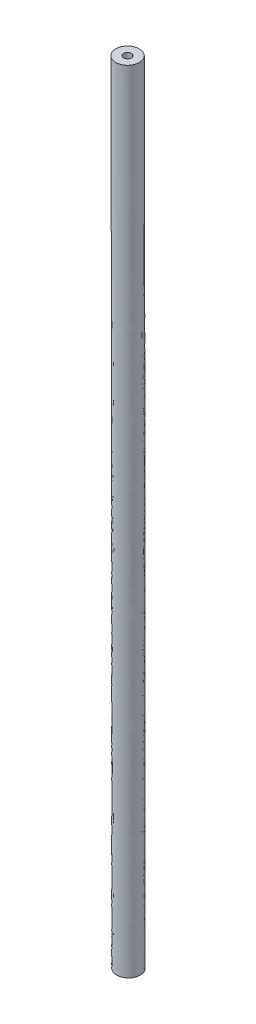
ISO-10303-21;
HEADER;
FILE_DESCRIPTION(('STEP AP214'),'2;1');
FILE_NAME('part.step','',(''),(''),'','','');
FILE_SCHEMA(('AUTOMOTIVE_DESIGN { 1 0 10303 214 1 1 1 1 }'));
ENDSEC;
DATA;
#1=APPLICATION_CONTEXT('core data for automotive mechanical design processes');
#2=APPLICATION_PROTOCOL_DEFINITION('international standard','automotive_design',2000,#1);
#3=PRODUCT_CONTEXT('',#1,'mechanical');
#4=PRODUCT('Part','Part','',(#3));
#5=PRODUCT_RELATED_PRODUCT_CATEGORY('part','',(#4));
#6=PRODUCT_DEFINITION_FORMATION('','',#4);
#7=PRODUCT_DEFINITION_CONTEXT('part definition',#1,'design');
#8=PRODUCT_DEFINITION('design','',#6,#7);
#9=PRODUCT_DEFINITION_SHAPE('','',#8);
#10=(LENGTH_UNIT() NAMED_UNIT(*) SI_UNIT(.MILLI.,.METRE.));
#11=(NAMED_UNIT(*) PLANE_ANGLE_UNIT() SI_UNIT($,.RADIAN.));
#12=(NAMED_UNIT(*) SI_UNIT($,.STERADIAN.) SOLID_ANGLE_UNIT());
#13=UNCERTAINTY_MEASURE_WITH_UNIT(LENGTH_MEASURE(1.E-05),#10,'distance_accuracy_value','');
#14=(GEOMETRIC_REPRESENTATION_CONTEXT(3) GLOBAL_UNCERTAINTY_ASSIGNED_CONTEXT((#13)) GLOBAL_UNIT_ASSIGNED_CONTEXT((#10,
#11,#12)) REPRESENTATION_CONTEXT('',''));
#15=CARTESIAN_POINT('',(0.,0.,0.));
#16=DIRECTION('',(0.,0.,1.));
#17=DIRECTION('',(1.,0.,0.));
#18=AXIS2_PLACEMENT_3D('',#15,#16,#17);
#19=CARTESIAN_POINT('',(0.,0.,1.5));
#20=CARTESIAN_POINT('',(0.,8.33333333335613,1.5));
#21=CARTESIAN_POINT('',(1.1843399654323E-07,16.6666666666842,1.5));
#22=CARTESIAN_POINT('',(-2.36868233125933E-07,41.6666840276966,1.5));
#23=CARTESIAN_POINT('',(-0.0208335396008937,58.3333680546949,1.5));
#24=CARTESIAN_POINT('',(-0.083333163740996,83.3333333337121,1.5));
#25=CARTESIAN_POINT('',(-0.104166609703206,91.6666666666926,1.5));
#26=CARTESIAN_POINT('',(-0.124999951173884,100.,1.5));
#27=CARTESIAN_POINT('',(3.,0.,1.5));
#28=CARTESIAN_POINT('',(3.,8.33333333335613,1.5));
#29=CARTESIAN_POINT('',(3.00000011844845,16.6660416683961,1.5));
#30=CARTESIAN_POINT('',(2.99999976310286,41.6679340255749,1.5));
#31=CARTESIAN_POINT('',(2.97916021038792,58.339618040183,1.5));
#32=CARTESIAN_POINT('',(2.91665589881627,83.3414583115083,1.5));
#33=CARTESIAN_POINT('',(2.89582401533342,91.6741666461848,1.5));
#34=CARTESIAN_POINT('',(2.87499067386274,100.007499979492,1.5));
#35=CARTESIAN_POINT('',(3.,0.,-1.5));
#36=CARTESIAN_POINT('',(3.,8.33333333335613,-1.5));
#37=CARTESIAN_POINT('',(3.00000011844845,16.6660416683961,-1.5));
#38=CARTESIAN_POINT('',(2.99999976310286,41.6679340255749,-1.5));
#39=CARTESIAN_POINT('',(2.97916021038792,58.339618040183,-1.5));
#40=CARTESIAN_POINT('',(2.91665589881627,83.3414583115083,-1.5));
#41=CARTESIAN_POINT('',(2.89582401533342,91.6741666461848,-1.5));
#42=CARTESIAN_POINT('',(2.87499067386274,100.007499979492,-1.5));
#43=CARTESIAN_POINT('',(0.,0.,-1.5));
#44=CARTESIAN_POINT('',(0.,8.33333333335613,-1.5));
#45=CARTESIAN_POINT('',(1.18433996726927E-07,16.6666666666842,-1.5));
#46=CARTESIAN_POINT('',(-2.36868232942236E-07,41.6666840276966,-1.5));
#47=CARTESIAN_POINT('',(-0.0208335396008935,58.3333680546949,-1.5));
#48=CARTESIAN_POINT('',(-0.0833331637409958,83.3333333337121,-1.5));
#49=CARTESIAN_POINT('',(-0.104166609703206,91.6666666666926,-1.5));
#50=CARTESIAN_POINT('',(-0.124999951173884,100.,-1.5));
#51=CARTESIAN_POINT('',(-3.,0.,-1.5));
#52=CARTESIAN_POINT('',(-3.,8.33333333335613,-1.5));
#53=CARTESIAN_POINT('',(-2.99999988158046,16.6672916649723,-1.5));
#54=CARTESIAN_POINT('',(-3.00000023683932,41.6654340298184,-1.5));
#55=CARTESIAN_POINT('',(-3.02082728958971,58.3271180692068,-1.5));
#56=CARTESIAN_POINT('',(-3.08332222629827,83.3252083559159,-1.5));
#57=CARTESIAN_POINT('',(-3.10415723473983,91.6591666872005,-1.5));
#58=CARTESIAN_POINT('',(-3.12499057621051,99.9925000205079,-1.5));
#59=CARTESIAN_POINT('',(-3.,0.,1.5));
#60=CARTESIAN_POINT('',(-3.,8.33333333335613,1.5));
#61=CARTESIAN_POINT('',(-2.99999988158046,16.6672916649723,1.5));
#62=CARTESIAN_POINT('',(-3.00000023683932,41.6654340298184,1.5));
#63=CARTESIAN_POINT('',(-3.02082728958971,58.3271180692068,1.5));
#64=CARTESIAN_POINT('',(-3.08332222629827,83.3252083559159,1.5));
#65=CARTESIAN_POINT('',(-3.10415723473983,91.6591666872005,1.5));
#66=CARTESIAN_POINT('',(-3.12499057621051,99.9925000205079,1.5));
#67=CARTESIAN_POINT('',(0.,0.,1.5));
#68=CARTESIAN_POINT('',(0.,8.33333333335613,1.5));
#69=CARTESIAN_POINT('',(1.1843399654323E-07,16.6666666666842,1.5));
#70=CARTESIAN_POINT('',(-2.36868233125933E-07,41.6666840276966,1.5));
#71=CARTESIAN_POINT('',(-0.0208335396008937,58.3333680546949,1.5));
#72=CARTESIAN_POINT('',(-0.083333163740996,83.3333333337121,1.5));
#73=CARTESIAN_POINT('',(-0.104166609703206,91.6666666666926,1.5));
#74=CARTESIAN_POINT('',(-0.124999951173884,100.,1.5));
#75=(BOUNDED_SURFACE() B_SPLINE_SURFACE(3,3,((#19,#20,#21,#22,#23,#24,#25,#26),(#27,#28,#29,#30,
#31,#32,#33,#34),(#35,#36,#37,#38,#39,#40,#41,#42),(#43,#44,#45,#46,#47,#48,#49,#50),(#51,#52,
#53,#54,#55,#56,#57,#58),(#59,#60,#61,#62,#63,#64,#65,#66),(#67,#68,#69,#70,#71,#72,#73,#74)),
.UNSPECIFIED.,.T.,.F.,.F.) B_SPLINE_SURFACE_WITH_KNOTS((4,3,4),(4,2,2,4),(0.,0.5,1.),(0.,
0.249999674480089,0.749999544271539,1.),
.UNSPECIFIED.) GEOMETRIC_REPRESENTATION_ITEM() RATIONAL_B_SPLINE_SURFACE(((1.,1.,1.,1.,1.,1.,1.,
1.),(0.333333333333333,0.333333333333333,0.333333333333333,0.333333333333333,0.333333333333333,
0.333333333333333,0.333333333333333,0.333333333333333),(0.333333333333333,0.333333333333333,
0.333333333333333,0.333333333333333,0.333333333333333,0.333333333333333,0.333333333333333,
0.333333333333333),(1.,1.,1.,1.,1.,1.,1.,1.),(0.333333333333333,0.333333333333333,
0.333333333333333,0.333333333333333,0.333333333333333,0.333333333333333,0.333333333333333,
0.333333333333333),(0.333333333333333,0.333333333333333,0.333333333333333,0.333333333333333,
0.333333333333333,0.333333333333333,0.333333333333333,0.333333333333333),(1.,1.,1.,1.,1.,1.,1.,1.))) REPRESENTATION_ITEM('') SURFACE());
#76=CARTESIAN_POINT('',(-0.124999951173884,100.,0.));
#77=DIRECTION('',(-0.00249999316404452,0.999996875012207,0.));
#78=DIRECTION('',(0.,0.,1.));
#79=AXIS2_PLACEMENT_3D('',#76,#77,#78);
#80=CIRCLE('',#79,1.5);
#81=CARTESIAN_POINT('',(-0.124999951173884,100.,1.5));
#82=VERTEX_POINT('',#81);
#83=EDGE_CURVE('E58',#82,#82,#80,.T.);
#84=CARTESIAN_POINT('',(0.,0.,0.));
#85=DIRECTION('',(0.,1.,0.));
#86=DIRECTION('',(0.,0.,1.));
#87=AXIS2_PLACEMENT_3D('',#84,#85,#86);
#88=CIRCLE('',#87,1.5);
#89=CARTESIAN_POINT('',(0.,0.,1.5));
#90=VERTEX_POINT('',#89);
#91=EDGE_CURVE('E64',#90,#90,#88,.T.);
#92=CARTESIAN_POINT('',(-0.124999951173884,100.,1.5));
#93=CARTESIAN_POINT('',(-0.123697869705612,99.4791676161011,1.5));
#94=CARTESIAN_POINT('',(-0.122395787829077,98.9583352322032,1.5));
#95=CARTESIAN_POINT('',(-0.119791623412733,97.9166704644094,1.5));
#96=CARTESIAN_POINT('',(-0.118489540872922,97.3958380805136,1.5));
#97=CARTESIAN_POINT('',(-0.115885375283274,96.3541733127234,1.5));
#98=CARTESIAN_POINT('',(-0.114583292233436,95.8333409288291,1.5));
#99=CARTESIAN_POINT('',(-0.111979125775865,94.7916761610414,1.5));
#100=CARTESIAN_POINT('',(-0.110677042368133,94.2708437771481,1.5));
#101=CARTESIAN_POINT('',(-0.108072875351362,93.2291790093619,1.5));
#102=CARTESIAN_POINT('',(-0.106770791742324,92.708346625469,1.5));
#103=CARTESIAN_POINT('',(-0.104166624462821,91.6666818576833,1.5));
#104=CARTESIAN_POINT('',(-0.102864540792357,91.1458494737905,1.5));
#105=CARTESIAN_POINT('',(-0.100260373592268,90.1041847060041,1.5));
#106=CARTESIAN_POINT('',(-0.0989582900626438,89.5833523221106,1.5));
#107=CARTESIAN_POINT('',(-0.0963541231136585,88.5416875543229,1.5));
#108=CARTESIAN_POINT('',(-0.0950520396942972,88.0208551704287,1.5));
#109=CARTESIAN_POINT('',(-0.0924478738042515,86.9791904026374,1.5));
#110=CARTESIAN_POINT('',(-0.0911457913335672,86.4583580187402,1.5));
#111=CARTESIAN_POINT('',(-0.0885416249361668,85.4166932509489,1.5));
#112=CARTESIAN_POINT('',(-0.0872395410094508,84.8958608670547,1.5));
#113=CARTESIAN_POINT('',(-0.0846353813987776,83.8541960992449,1.5));
#114=CARTESIAN_POINT('',(-0.0833333057148204,83.3333637153292,1.5));
#115=CARTESIAN_POINT('',(-0.0807291271175817,82.2916989475652,1.5));
#116=CARTESIAN_POINT('',(-0.0794270242043002,81.770866563717,1.5));
#117=CARTESIAN_POINT('',(-0.076822924256325,80.7292017957535,1.5));
#118=CARTESIAN_POINT('',(-0.0755209272216313,80.2083694116382,1.5));
#119=CARTESIAN_POINT('',(-0.0729165429896368,79.1667046443863,1.5));
#120=CARTESIAN_POINT('',(-0.071614155792336,78.6458722612496,1.5));
#121=CARTESIAN_POINT('',(-0.0690108432103649,77.604207491304,1.5));
#122=CARTESIAN_POINT('',(-0.0677099178256946,77.083375104495,1.5));
#123=CARTESIAN_POINT('',(-0.0651026179275992,76.0417103445597,1.5));
#124=CARTESIAN_POINT('',(-0.0637962434141739,75.5208779714334,1.5));
#125=CARTESIAN_POINT('',(-0.0612038379675766,74.4792131742251,1.5));
#126=CARTESIAN_POINT('',(-0.0599178070343994,73.9583807501431,1.5));
#127=CARTESIAN_POINT('',(-0.057391886516253,72.9167157898678,1.5));
#128=CARTESIAN_POINT('',(-0.0561519969312838,72.3958832536746,1.5));
#129=CARTESIAN_POINT('',(-0.053711446616965,71.3542180895589,1.5));
#130=CARTESIAN_POINT('',(-0.0525107858876152,70.8333854616365,1.5));
#131=CARTESIAN_POINT('',(-0.0501505454799054,69.7917201126317,1.5));
#132=CARTESIAN_POINT('',(-0.0489909658015454,69.2708873915493,1.5));
#133=CARTESIAN_POINT('',(-0.0467123912001249,68.2292218606384,1.5));
#134=CARTESIAN_POINT('',(-0.0455933962770645,67.7083890508099,1.5));
#135=CARTESIAN_POINT('',(-0.0433961241668361,66.6667233452546,1.5));
#136=CARTESIAN_POINT('',(-0.0423178469796682,66.1458904495278,1.5));
#137=CARTESIAN_POINT('',(-0.040201974707746,65.1042245754435,1.5));
#138=CARTESIAN_POINT('',(-0.0391643796229916,64.5833915970859,1.5));
#139=CARTESIAN_POINT('',(-0.037129881102422,63.5417255608949,1.5));
#140=CARTESIAN_POINT('',(-0.0361329776666066,63.0208925030615,1.5));
#141=CARTESIAN_POINT('',(-0.0341798598844948,61.979226311104,1.5));
#142=CARTESIAN_POINT('',(-0.0332236455381982,61.45839317698,1.5));
#143=CARTESIAN_POINT('',(-0.0313519066194821,60.4167268356183,1.5));
#144=CARTESIAN_POINT('',(-0.0304363820470625,59.8958936283806,1.5));
#145=CARTESIAN_POINT('',(-0.0286460224912905,58.8542271439709,1.5));
#146=CARTESIAN_POINT('',(-0.0277711875079381,58.3333938667989,1.5));
#147=CARTESIAN_POINT('',(-0.0260622071783838,57.2917272456992,1.5));
#148=CARTESIAN_POINT('',(-0.0252280618321819,56.7708939017714,1.5));
#149=CARTESIAN_POINT('',(-0.023600460762608,55.729227150339,1.5));
#150=CARTESIAN_POINT('',(-0.0228070050392361,55.2083937428344,1.5));
#151=CARTESIAN_POINT('',(-0.0212607832177234,54.166726867427,1.5));
#152=CARTESIAN_POINT('',(-0.0205080171195825,53.6458933995242,1.5));
#153=CARTESIAN_POINT('',(-0.0190431745464508,52.6042264064993,1.5));
#154=CARTESIAN_POINT('',(-0.0183310980714599,52.0833928813772,1.5));
#155=CARTESIAN_POINT('',(-0.0169476347437539,51.0417257770923,1.5));
#156=CARTESIAN_POINT('',(-0.0162762478910388,50.5208921979296,1.5));
#157=CARTESIAN_POINT('',(-0.0149741638066651,49.4792249887423,1.5));
#158=CARTESIAN_POINT('',(-0.0143434665750066,48.9583913587177,1.5));
#159=CARTESIAN_POINT('',(-0.0131227617316994,47.9167240509856,1.5));
#160=CARTESIAN_POINT('',(-0.0125327541200508,47.395890373278,1.5));
#161=CARTESIAN_POINT('',(-0.0113934285153721,46.3542229733585,1.5));
#162=CARTESIAN_POINT('',(-0.0108441105223419,45.8333892511467,1.5));
#163=CARTESIAN_POINT('',(-0.00978616415471516,44.7917217653975,1.5));
#164=CARTESIAN_POINT('',(-0.00927753578011855,44.2708880018601,1.5));
#165=CARTESIAN_POINT('',(-0.00830096864469269,43.2292204366387,1.5));
#166=CARTESIAN_POINT('',(-0.00783302988386345,42.7083866349546,1.5));
#167=CARTESIAN_POINT('',(-0.00693784198802454,41.6667189966185,1.5));
#168=CARTESIAN_POINT('',(-0.00651059285301489,41.1458851599665,1.5));
#169=CARTESIAN_POINT('',(-0.00569678415847505,40.1042174548733,1.5));
#170=CARTESIAN_POINT('',(-0.00531022459894487,39.5833835864321,1.5));
#171=CARTESIAN_POINT('',(-0.00457779523787488,38.5417158209393,1.5));
#172=CARTESIAN_POINT('',(-0.00423192543633508,38.0208819238877,1.5));
#173=CARTESIAN_POINT('',(-0.00358087490474493,36.9792141043529,1.5));
#174=CARTESIAN_POINT('',(-0.00327569417469461,36.4583801818697,1.5));
#175=CARTESIAN_POINT('',(-0.00270602434277876,35.4167123146504,1.5));
#176=CARTESIAN_POINT('',(-0.00244153524091326,34.8958783699144,1.5));
#177=CARTESIAN_POINT('',(-0.00195323911828917,33.8542104613682,1.5));
#178=CARTESIAN_POINT('',(-0.0017294320975306,33.3333764975581,1.5));
#179=CARTESIAN_POINT('',(-0.00132253576193922,32.2917085540424,1.5));
#180=CARTESIAN_POINT('',(-0.00113944644710644,31.7708745743367,1.5));
#181=CARTESIAN_POINT('',(-0.000813852564371756,30.72920660221,1.5));
#182=CARTESIAN_POINT('',(-0.000671347996469902,30.208372609789,1.5));
#183=CARTESIAN_POINT('',(-0.000427419811960242,29.1667046154047,1.5));
#184=CARTESIAN_POINT('',(-0.000325996195352485,28.6458706134415,1.5));
#185=CARTESIAN_POINT('',(-0.000162378048175824,27.6042026031726,1.5));
#186=CARTESIAN_POINT('',(-0.000100183517606972,27.083368594867,1.5));
#187=CARTESIAN_POINT('',(-2.19347923683434E-05,26.0417005750138,1.5));
#188=CARTESIAN_POINT('',(-5.88059769863282E-06,25.5208665634664,1.5));
#189=CARTESIAN_POINT('',(5.88059672635295E-06,24.4791985404677,1.5));
#190=CARTESIAN_POINT('',(1.5875964764369E-06,23.9583645290165,1.5));
#191=CARTESIAN_POINT('',(-1.54856249107005E-06,22.9166965060525,1.5));
#192=CARTESIAN_POINT('',(-3.91721208659882E-07,22.3958624945398,1.5));
#193=CARTESIAN_POINT('',(4.59727790409857E-07,21.3541944715306,1.5));
#194=CARTESIAN_POINT('',(1.54335507069109E-07,20.8333604600343,1.5));
#195=CARTESIAN_POINT('',(-6.63777108718377E-08,19.7916924370369,1.5));
#196=CARTESIAN_POINT('',(1.83013545280524E-08,19.270858425536,1.5));
#197=CARTESIAN_POINT('',(8.1627202032114E-08,18.2291904025353,1.5));
#198=CARTESIAN_POINT('',(6.02739841362596E-08,17.7083563910354,1.5));
#199=CARTESIAN_POINT('',(4.46858065529812E-08,16.6666883680352,1.5));
#200=CARTESIAN_POINT('',(5.04508468655642E-08,16.1458543565349,1.5));
#201=CARTESIAN_POINT('',(5.36415795697543E-08,15.1041863335342,1.5));
#202=CARTESIAN_POINT('',(5.1067271961359E-08,14.5833523220338,1.5));
#203=CARTESIAN_POINT('',(4.73001196877952E-08,13.5416842990329,1.5));
#204=CARTESIAN_POINT('',(4.6107275022627E-08,13.0208502875324,1.5));
#205=CARTESIAN_POINT('',(4.27183391588951E-08,11.9791822645312,1.5));
#206=CARTESIAN_POINT('',(4.05222479603309E-08,11.4583482530305,1.5));
#207=CARTESIAN_POINT('',(3.59857739228602E-08,10.4166802300289,1.5));
#208=CARTESIAN_POINT('',(3.36453910839536E-08,9.89584621852805,1.5));
#209=CARTESIAN_POINT('',(2.88101515209782E-08,8.85417819552616,1.5));
#210=CARTESIAN_POINT('',(2.63152947969094E-08,8.33334418402512,1.5));
#211=CARTESIAN_POINT('',(2.13938094006046E-08,7.29167616102288,1.5));
#212=CARTESIAN_POINT('',(1.89671807283687E-08,6.77084214952166,1.5));
#213=CARTESIAN_POINT('',(1.4342453783339E-08,5.72917412651905,1.5));
#214=CARTESIAN_POINT('',(1.21443555105454E-08,5.20834011501764,1.5));
#215=CARTESIAN_POINT('',(8.15370588773779E-09,4.16667209201464,1.5));
#216=CARTESIAN_POINT('',(6.36115453772402E-09,3.64583808051305,1.5));
#217=CARTESIAN_POINT('',(3.35415817028629E-09,2.60417005750965,1.5));
#218=CARTESIAN_POINT('',(2.13971315286255E-09,2.08333604600784,1.5));
#219=CARTESIAN_POINT('',(4.62603138796683E-10,1.04166802300403,1.5));
#220=CARTESIAN_POINT('',(0.,0.520834011502014,1.5));
#221=CARTESIAN_POINT('',(0.,0.,1.5));
#222=B_SPLINE_CURVE_WITH_KNOTS('',3,(#92,#93,#94,#95,#96,#97,#98,#99,#100,#101,#102,#103,#104,
#105,#106,#107,#108,#109,#110,#111,#112,#113,#114,#115,#116,#117,#118,#119,#120,#121,#122,#123,
#124,#125,#126,#127,#128,#129,#130,#131,#132,#133,#134,#135,#136,#137,#138,#139,#140,#141,#142,
#143,#144,#145,#146,#147,#148,#149,#150,#151,#152,#153,#154,#155,#156,#157,#158,#159,#160,#161,
#162,#163,#164,#165,#166,#167,#168,#169,#170,#171,#172,#173,#174,#175,#176,#177,#178,#179,#180,
#181,#182,#183,#184,#185,#186,#187,#188,#189,#190,#191,#192,#193,#194,#195,#196,#197,#198,#199,
#200,#201,#202,#203,#204,#205,#206,#207,#208,#209,#210,#211,#212,#213,#214,#215,#216,#217,#218,
#219,#220,#221),.UNSPECIFIED.,.F.,.F.,(4,2,2,2,2,2,2,2,2,2,2,2,2,2,2,2,2,2,2,2,2,2,2,2,2,2,2,2,
2,2,2,2,2,2,2,2,2,2,2,2,2,2,2,2,2,2,2,2,2,2,2,2,2,2,2,2,2,2,2,2,2,2,2,2,4),(0.,1.56250203449652,
3.12500406899191,4.68750610348654,6.25000813798088,7.81251017247528,9.37501220697015,
10.9375142414659,12.5000162759629,14.0625183104616,15.6250203449624,17.1875223794657,
18.7500244139719,20.3125264484813,21.8750284829945,23.4375305175117,25.0000325520335,
26.562534586158,28.1250366202783,29.6875386543946,31.2500406885072,32.8125427226163,
34.3750447567223,35.9375467908253,37.5000488249256,39.0625508590235,40.6250528931192,
42.1875549272129,43.7500569613049,45.3125589953954,46.8750610294846,48.4375630635728,
50.0000650976601,51.5625671317468,53.125069165833,54.687571199919,56.250073234005,
57.8125752680912,59.3750773021777,60.9375793362648,62.5000813703526,64.0625834044413,
65.6250854385312,67.1875874726223,68.7500895067149,70.3125915408092,71.8750935749053,
73.4375956090035,75.0000976431038,76.5625996776027,78.125101712102,79.6876037466016,
81.2501057811016,82.8126078156019,84.3751098501026,85.9376118846038,87.5001139191054,
89.0626159536075,90.6251179881101,92.1876200226132,93.7501220571168,95.312624091621,
96.8751261261258,98.4376281606312,100.000130195137),.UNSPECIFIED.);
#223=EDGE_CURVE('',#82,#90,#222,.T.);
#224=ORIENTED_EDGE('',*,*,#83,.F.);
#225=ORIENTED_EDGE('',*,*,#91,.T.);
#226=ORIENTED_EDGE('',*,*,#223,.T.);
#227=ORIENTED_EDGE('',*,*,#223,.F.);
#228=EDGE_LOOP('',(#224,#226,#225,#227));
#229=FACE_BOUND('',#228,.T.);
#230=ADVANCED_FACE('F43',(#229),#75,.T.);
#231=CARTESIAN_POINT('',(0.,0.,0.));
#232=DIRECTION('',(0.,1.,0.));
#233=DIRECTION('',(0.,0.,1.));
#234=AXIS2_PLACEMENT_3D('',#231,#232,#233);
#235=PLANE('',#234);
#236=CARTESIAN_POINT('',(0.,0.,0.));
#237=DIRECTION('',(0.,-1.,0.));
#238=DIRECTION('',(0.,0.,-1.));
#239=AXIS2_PLACEMENT_3D('',#236,#237,#238);
#240=CIRCLE('',#239,0.999999999999999);
#241=CARTESIAN_POINT('',(0.,0.,-0.999999999999999));
#242=VERTEX_POINT('',#241);
#243=EDGE_CURVE('E79',#242,#242,#240,.T.);
#244=ORIENTED_EDGE('',*,*,#243,.F.);
#245=EDGE_LOOP('',(#244));
#246=FACE_BOUND('',#245,.T.);
#247=ORIENTED_EDGE('',*,*,#91,.F.);
#248=EDGE_LOOP('',(#247));
#249=FACE_BOUND('',#248,.T.);
#250=ADVANCED_FACE('F88',(#246,#249),#235,.F.);
#251=CARTESIAN_POINT('',(-0.124999951173884,100.,0.));
#252=DIRECTION('',(-0.00249999316404452,0.999996875012207,0.));
#253=DIRECTION('',(0.,0.,1.));
#254=AXIS2_PLACEMENT_3D('',#251,#252,#253);
#255=PLANE('',#254);
#256=CARTESIAN_POINT('',(-0.124999951173884,100.,0.));
#257=DIRECTION('',(-0.00249999316404452,0.999996875012207,0.));
#258=DIRECTION('',(0.,0.,1.));
#259=AXIS2_PLACEMENT_3D('',#256,#257,#258);
#260=CIRCLE('',#259,0.5);
#261=CARTESIAN_POINT('',(-0.124999951173884,100.,0.5));
#262=VERTEX_POINT('',#261);
#263=EDGE_CURVE('E10',#262,#262,#260,.F.);
#264=ORIENTED_EDGE('',*,*,#263,.T.);
#265=EDGE_LOOP('',(#264));
#266=FACE_BOUND('',#265,.T.);
#267=ORIENTED_EDGE('',*,*,#83,.T.);
#268=EDGE_LOOP('',(#267));
#269=FACE_BOUND('',#268,.T.);
#270=ADVANCED_FACE('F91',(#266,#269),#255,.T.);
#271=CARTESIAN_POINT('',(0.,0.,0.5));
#272=CARTESIAN_POINT('',(0.,8.33333333335613,0.5));
#273=CARTESIAN_POINT('',(1.1843399654323E-07,16.6666666666842,0.5));
#274=CARTESIAN_POINT('',(-2.36868233125933E-07,41.6666840276966,0.5));
#275=CARTESIAN_POINT('',(-0.0208335396008937,58.3333680546949,0.5));
#276=CARTESIAN_POINT('',(-0.083333163740996,83.3333333337121,0.5));
#277=CARTESIAN_POINT('',(-0.104166609703206,91.6666666666926,0.5));
#278=CARTESIAN_POINT('',(-0.124999951173884,100.,0.5));
#279=CARTESIAN_POINT('',(-1.,0.,0.5));
#280=CARTESIAN_POINT('',(-0.999999999999999,8.33333333335613,0.5));
#281=CARTESIAN_POINT('',(-0.999999881570521,16.666874999442,0.5));
#282=CARTESIAN_POINT('',(-1.0000002368592,41.6662673617469,0.5));
#283=CARTESIAN_POINT('',(-1.02083145626323,58.3312847261218,0.5));
#284=CARTESIAN_POINT('',(-1.08332951792705,83.3306250078186,0.5));
#285=CARTESIAN_POINT('',(-1.10416348471541,91.6641666735286,0.5));
#286=CARTESIAN_POINT('',(-1.12499682618609,99.997500006836,0.5));
#287=CARTESIAN_POINT('',(-1.,0.,-0.5));
#288=CARTESIAN_POINT('',(-0.999999999999999,8.33333333335613,-0.5));
#289=CARTESIAN_POINT('',(-0.999999881570521,16.666874999442,-0.5));
#290=CARTESIAN_POINT('',(-1.0000002368592,41.6662673617469,-0.5));
#291=CARTESIAN_POINT('',(-1.02083145626323,58.3312847261218,-0.5));
#292=CARTESIAN_POINT('',(-1.08332951792705,83.3306250078186,-0.5));
#293=CARTESIAN_POINT('',(-1.10416348471541,91.6641666735286,-0.5));
#294=CARTESIAN_POINT('',(-1.12499682618609,99.997500006836,-0.5));
#295=CARTESIAN_POINT('',(0.,0.,-0.5));
#296=CARTESIAN_POINT('',(0.,8.33333333335613,-0.5));
#297=CARTESIAN_POINT('',(1.18433996604462E-07,16.6666666666842,-0.5));
#298=CARTESIAN_POINT('',(-2.36868233064701E-07,41.6666840276966,-0.5));
#299=CARTESIAN_POINT('',(-0.0208335396008937,58.3333680546949,-0.5));
#300=CARTESIAN_POINT('',(-0.0833331637409959,83.3333333337121,-0.5));
#301=CARTESIAN_POINT('',(-0.104166609703206,91.6666666666926,-0.5));
#302=CARTESIAN_POINT('',(-0.124999951173884,100.,-0.5));
#303=CARTESIAN_POINT('',(1.,0.,-0.5));
#304=CARTESIAN_POINT('',(1.,8.33333333335613,-0.5));
#305=CARTESIAN_POINT('',(1.00000011843851,16.6664583339263,-0.5));
#306=CARTESIAN_POINT('',(0.999999763122732,41.6671006936464,-0.5));
#307=CARTESIAN_POINT('',(0.979164377061443,58.3354513832681,-0.5));
#308=CARTESIAN_POINT('',(0.916663190445062,83.3360416596056,-0.5));
#309=CARTESIAN_POINT('',(0.895830265309001,91.6691666598567,-0.5));
#310=CARTESIAN_POINT('',(0.874996923838323,100.002499993164,-0.5));
#311=CARTESIAN_POINT('',(1.,0.,0.5));
#312=CARTESIAN_POINT('',(1.,8.33333333335613,0.5));
#313=CARTESIAN_POINT('',(1.00000011843851,16.6664583339263,0.5));
#314=CARTESIAN_POINT('',(0.999999763122732,41.6671006936464,0.5));
#315=CARTESIAN_POINT('',(0.979164377061443,58.3354513832681,0.5));
#316=CARTESIAN_POINT('',(0.916663190445062,83.3360416596056,0.5));
#317=CARTESIAN_POINT('',(0.895830265309001,91.6691666598567,0.5));
#318=CARTESIAN_POINT('',(0.874996923838323,100.002499993164,0.5));
#319=CARTESIAN_POINT('',(0.,0.,0.5));
#320=CARTESIAN_POINT('',(0.,8.33333333335613,0.5));
#321=CARTESIAN_POINT('',(1.1843399654323E-07,16.6666666666842,0.5));
#322=CARTESIAN_POINT('',(-2.36868233125933E-07,41.6666840276966,0.5));
#323=CARTESIAN_POINT('',(-0.0208335396008937,58.3333680546949,0.5));
#324=CARTESIAN_POINT('',(-0.083333163740996,83.3333333337121,0.5));
#325=CARTESIAN_POINT('',(-0.104166609703206,91.6666666666926,0.5));
#326=CARTESIAN_POINT('',(-0.124999951173884,100.,0.5));
#327=(BOUNDED_SURFACE() B_SPLINE_SURFACE(3,3,((#271,#272,#273,#274,#275,#276,#277,#278),(#279,
#280,#281,#282,#283,#284,#285,#286),(#287,#288,#289,#290,#291,#292,#293,#294),(#295,#296,#297,
#298,#299,#300,#301,#302),(#303,#304,#305,#306,#307,#308,#309,#310),(#311,#312,#313,#314,#315,
#316,#317,#318),(#319,#320,#321,#322,#323,#324,#325,#326)),.UNSPECIFIED.,.T.,.F.,
.F.) B_SPLINE_SURFACE_WITH_KNOTS((4,3,4),(4,2,2,4),(0.,0.5,1.),(0.,0.249999674480089,
0.749999544271539,1.),
.UNSPECIFIED.) GEOMETRIC_REPRESENTATION_ITEM() RATIONAL_B_SPLINE_SURFACE(((1.,1.,1.,1.,1.,1.,1.,
1.),(0.333333333333333,0.333333333333333,0.333333333333333,0.333333333333333,0.333333333333333,
0.333333333333333,0.333333333333333,0.333333333333333),(0.333333333333333,0.333333333333333,
0.333333333333333,0.333333333333333,0.333333333333333,0.333333333333333,0.333333333333333,
0.333333333333333),(1.,1.,1.,1.,1.,1.,1.,1.),(0.333333333333333,0.333333333333333,
0.333333333333333,0.333333333333333,0.333333333333333,0.333333333333333,0.333333333333333,
0.333333333333333),(0.333333333333333,0.333333333333333,0.333333333333333,0.333333333333333,
0.333333333333333,0.333333333333333,0.333333333333333,0.333333333333333),(1.,1.,1.,1.,1.,1.,1.,1.))) REPRESENTATION_ITEM('') SURFACE());
#328=CARTESIAN_POINT('',(2.37975541977947E-08,7.80043030951378,0.5));
#329=CARTESIAN_POINT('',(0.0281075894669719,7.80043030870996,0.500002995339656));
#330=CARTESIAN_POINT('',(0.0561968191187145,7.80043030790666,0.497626858992947));
#331=CARTESIAN_POINT('',(0.111621959361383,7.8004303063216,0.48819101041065));
#332=CARTESIAN_POINT('',(0.138956922006168,7.80043030553987,0.481125661275685));
#333=CARTESIAN_POINT('',(0.192032362295391,7.80043030402199,0.462508868038939));
#334=CARTESIAN_POINT('',(0.21777381188682,7.80043030328582,0.450960190388562));
#335=CARTESIAN_POINT('',(0.266954008180003,7.80043030187933,0.423704880702544));
#336=CARTESIAN_POINT('',(0.290392687305625,7.80043030120901,0.407998126695685));
#337=CARTESIAN_POINT('',(0.334299419799121,7.80043029995333,0.372873073172779));
#338=CARTESIAN_POINT('',(0.354767575025228,7.80043029936796,0.3534549009729));
#339=CARTESIAN_POINT('',(0.392154211799039,7.80043029829874,0.311457059716541));
#340=CARTESIAN_POINT('',(0.409072553951802,7.80043029781489,0.288877266566774));
#341=CARTESIAN_POINT('',(0.438867925152837,7.80043029696277,0.241214258517525));
#342=CARTESIAN_POINT('',(0.451747719474719,7.80043029659442,0.216132772155542));
#343=CARTESIAN_POINT('',(0.473131001611848,7.80043029598287,0.164129559253902));
#344=CARTESIAN_POINT('',(0.481628628080867,7.80043029573984,0.137205422293655));
#345=CARTESIAN_POINT('',(0.493975666076001,7.80043029538672,0.0823312590464843));
#346=CARTESIAN_POINT('',(0.497828274598015,7.80043029527654,0.0543819520141865));
#347=CARTESIAN_POINT('',(0.500786703447857,7.80043029519194,-0.00176806901600188));
#348=CARTESIAN_POINT('',(0.499892310031692,7.80043029521752,-0.0299687942774624));
#349=CARTESIAN_POINT('',(0.493381782486407,7.80043029540371,-0.0858183884590995));
#350=CARTESIAN_POINT('',(0.487765882934779,7.80043029556432,-0.113467284725804));
#351=CARTESIAN_POINT('',(0.471971603020158,7.80043029601603,-0.167431361433723));
#352=CARTESIAN_POINT('',(0.461792974762954,7.80043029630713,-0.1937464693234));
#353=CARTESIAN_POINT('',(0.43717078277473,7.80043029701131,-0.244276644874637));
#354=CARTESIAN_POINT('',(0.422730180941692,7.8004302974243,-0.268493155905963));
#355=CARTESIAN_POINT('',(0.389968749002039,7.80043029836124,-0.314190744666071));
#356=CARTESIAN_POINT('',(0.371642771265131,7.80043029888535,-0.335668132343202));
#357=CARTESIAN_POINT('',(0.331670682581857,7.80043030002851,-0.375211782977917));
#358=CARTESIAN_POINT('',(0.310029141720345,7.80043030064743,-0.393282666040333));
#359=CARTESIAN_POINT('',(0.263988551556852,7.80043030196414,-0.425560263914717));
#360=CARTESIAN_POINT('',(0.239585676625944,7.80043030266203,-0.439761522534888));
#361=CARTESIAN_POINT('',(0.188780179166108,7.80043030411499,-0.463843887013027));
#362=CARTESIAN_POINT('',(0.162380680563944,7.80043030486998,-0.473731584279764));
#363=CARTESIAN_POINT('',(0.108251777786722,7.80043030641798,-0.488951177794376));
#364=CARTESIAN_POINT('',(0.0805202279604878,7.80043030721106,-0.494275444433674));
#365=CARTESIAN_POINT('',(0.0245567843948881,7.80043030881151,-0.50018864816937));
#366=CARTESIAN_POINT('',(-0.00367510934447796,7.80043030961888,-0.500777585265759));
#367=CARTESIAN_POINT('',(-0.0597894704656397,7.80043031122364,-0.497206504394103));
#368=CARTESIAN_POINT('',(-0.087672441601628,7.80043031202103,-0.493054395975839));
#369=CARTESIAN_POINT('',(-0.142389021223208,7.8004303135858,-0.480121694574829));
#370=CARTESIAN_POINT('',(-0.169220952307697,7.80043031435313,-0.471334002865891));
#371=CARTESIAN_POINT('',(-0.220990571148741,7.80043031583361,-0.449391217440836));
#372=CARTESIAN_POINT('',(-0.245930859762945,7.80043031654684,-0.436242258951292));
#373=CARTESIAN_POINT('',(-0.293284520085805,7.80043031790103,-0.405925612809836));
#374=CARTESIAN_POINT('',(-0.315694388185948,7.80043031854189,-0.388752451971315));
#375=CARTESIAN_POINT('',(-0.357282734750127,7.80043031973119,-0.350910802016555));
#376=CARTESIAN_POINT('',(-0.376465475986871,7.80043032027976,-0.330246997273022));
#377=CARTESIAN_POINT('',(-0.411104280947166,7.80043032127033,-0.285978451210709));
#378=CARTESIAN_POINT('',(-0.426557749828999,7.80043032171225,-0.262371679386505));
#379=CARTESIAN_POINT('',(-0.453281236491611,7.80043032247646,-0.212900110647021));
#380=CARTESIAN_POINT('',(-0.464551481529934,7.80043032279875,-0.187035436488716));
#381=CARTESIAN_POINT('',(-0.482590278081074,7.8004303233146,-0.133779770516633));
#382=CARTESIAN_POINT('',(-0.489358605911614,7.80043032350815,-0.106388702935736));
#383=CARTESIAN_POINT('',(-0.498200329122661,7.800430323761,-0.0508603219620314));
#384=CARTESIAN_POINT('',(-0.500273935881173,7.80043032382029,-0.0227230422248522));
#385=CARTESIAN_POINT('',(-0.499667730175622,7.80043032380296,0.0335197853532384));
#386=CARTESIAN_POINT('',(-0.49698464099531,7.80043032372623,0.0616252979642352));
#387=CARTESIAN_POINT('',(-0.486941731082437,7.80043032343904,0.116949062004578));
#388=CARTESIAN_POINT('',(-0.479588146018975,7.80043032322875,0.144168445660899));
#389=CARTESIAN_POINT('',(-0.460411843886068,7.80043032268037,0.197005893724182));
#390=CARTESIAN_POINT('',(-0.448586061358789,7.80043032234219,0.222622845679827));
#391=CARTESIAN_POINT('',(-0.420802160288989,7.80043032154766,0.271506729739701));
#392=CARTESIAN_POINT('',(-0.404844203997565,7.80043032109131,0.294773754064724));
#393=CARTESIAN_POINT('',(-0.369247838561464,7.80043032007336,0.338299255910957));
#394=CARTESIAN_POINT('',(-0.349609303199948,7.80043031951176,0.358557630214844));
#395=CARTESIAN_POINT('',(-0.307211222380057,7.80043031829929,0.395489274590521));
#396=CARTESIAN_POINT('',(-0.284451768496407,7.80043031764843,0.412162649817346));
#397=CARTESIAN_POINT('',(-0.23643909158116,7.8004303162754,0.441460605509409));
#398=CARTESIAN_POINT('',(-0.211184339903268,7.80043031555318,0.454082683740675));
#399=CARTESIAN_POINT('',(-0.158955119348986,7.80043031405955,0.47489349654724));
#400=CARTESIAN_POINT('',(-0.131982755544499,7.80043031328821,0.483087545434231));
#401=CARTESIAN_POINT('',(-0.070188923244585,7.80043031152104,0.496286603946513));
#402=CARTESIAN_POINT('',(-0.0350801689248472,7.800430310517,0.499996261608222));
#403=CARTESIAN_POINT('',(2.37975541977947E-08,7.80043030951378,0.5));
#404=B_SPLINE_CURVE_WITH_KNOTS('',3,(#328,#329,#330,#331,#332,#333,#334,#335,#336,#337,#338,
#339,#340,#341,#342,#343,#344,#345,#346,#347,#348,#349,#350,#351,#352,#353,#354,#355,#356,#357,
#358,#359,#360,#361,#362,#363,#364,#365,#366,#367,#368,#369,#370,#371,#372,#373,#374,#375,#376,
#377,#378,#379,#380,#381,#382,#383,#384,#385,#386,#387,#388,#389,#390,#391,#392,#393,#394,#395,
#396,#397,#398,#399,#400,#401,#402,#403),.UNSPECIFIED.,.T.,.F.,(4,2,2,2,2,2,2,2,2,2,2,2,2,2,2,2,
2,2,2,2,2,2,2,2,2,2,2,2,2,2,2,2,2,2,2,2,2,4),(0.,0.0841916038121803,0.168484598045449,
0.252725661494697,0.336969196308815,0.421209841758529,0.505453794571969,0.589639937279056,
0.673938392565784,0.758178795128886,0.842422990829857,0.926663001293356,1.01090758909287,
1.09509376764473,1.17939218708865,1.2635754401985,1.34787678505598,1.43204885674804,
1.51636138290078,1.60067390905367,1.68484598074589,1.76914732560356,1.8533305787136,
1.93762899815773,2.02181517670981,2.10605976450923,2.19029977497263,2.27454397067295,
2.35878437323541,2.44308282852294,2.52726897123083,2.61151292404406,2.69575356949357,
2.77999710430748,2.86423816775652,2.94853116198966,3.03272276580171,3.13779973056187),.UNSPECIFIED.);
#405=CARTESIAN_POINT('',(2.37975541977947E-08,7.80043030951378,0.5));
#406=VERTEX_POINT('',#405);
#407=EDGE_CURVE('E48',#406,#406,#404,.T.);
#408=ORIENTED_EDGE('',*,*,#407,.F.);
#409=EDGE_LOOP('',(#408));
#410=FACE_BOUND('',#409,.T.);
#411=ORIENTED_EDGE('',*,*,#263,.F.);
#412=EDGE_LOOP('',(#411));
#413=FACE_BOUND('',#412,.T.);
#414=ADVANCED_FACE('F96',(#410,#413),#327,.T.);
#415=CARTESIAN_POINT('',(0.,7.5,0.));
#416=DIRECTION('',(0.,-1.,0.));
#417=DIRECTION('',(0.,0.,-1.));
#418=AXIS2_PLACEMENT_3D('',#415,#416,#417);
#419=CONICAL_SURFACE('',#418,0.999999999999998,1.02974425867665);
#420=ORIENTED_EDGE('',*,*,#407,.T.);
#421=EDGE_LOOP('',(#420));
#422=FACE_BOUND('',#421,.T.);
#423=CARTESIAN_POINT('',(0.,7.5,0.));
#424=DIRECTION('',(0.,-1.,0.));
#425=DIRECTION('',(0.,0.,-1.));
#426=AXIS2_PLACEMENT_3D('',#423,#424,#425);
#427=CIRCLE('',#426,0.999999999999998);
#428=CARTESIAN_POINT('',(0.,7.5,-0.999999999999998));
#429=VERTEX_POINT('',#428);
#430=EDGE_CURVE('E67',#429,#429,#427,.T.);
#431=ORIENTED_EDGE('',*,*,#430,.T.);
#432=EDGE_LOOP('',(#431));
#433=FACE_BOUND('',#432,.T.);
#434=ADVANCED_FACE('F100',(#422,#433),#419,.F.);
#435=CARTESIAN_POINT('',(0.,0.,0.));
#436=DIRECTION('',(0.,-1.,0.));
#437=DIRECTION('',(0.,0.,-1.));
#438=AXIS2_PLACEMENT_3D('',#435,#436,#437);
#439=CYLINDRICAL_SURFACE('',#438,0.999999999999999);
#440=ORIENTED_EDGE('',*,*,#430,.F.);
#441=EDGE_LOOP('',(#440));
#442=FACE_BOUND('',#441,.T.);
#443=ORIENTED_EDGE('',*,*,#243,.T.);
#444=EDGE_LOOP('',(#443));
#445=FACE_BOUND('',#444,.T.);
#446=ADVANCED_FACE('F86',(#442,#445),#439,.F.);
#447=CLOSED_SHELL('',(#230,#250,#270,#414,#434,#446));
#448=MANIFOLD_SOLID_BREP('B2',#447);
#449=ADVANCED_BREP_SHAPE_REPRESENTATION('',(#18,#448),#14);
#450=SHAPE_DEFINITION_REPRESENTATION(#9,#449);
ENDSEC;
END-ISO-10303-21;
